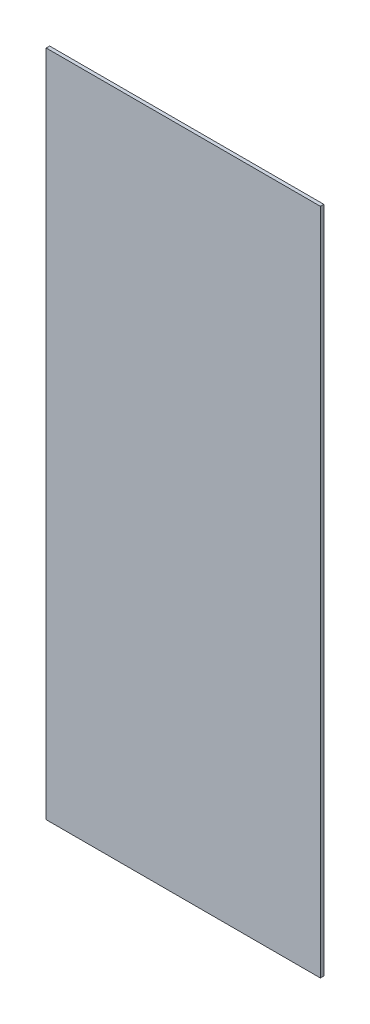
ISO-10303-21;
HEADER;
FILE_DESCRIPTION(('STEP AP214'),'2;1');
FILE_NAME('part.step','',(''),(''),'','','');
FILE_SCHEMA(('AUTOMOTIVE_DESIGN { 1 0 10303 214 1 1 1 1 }'));
ENDSEC;
DATA;
#1=APPLICATION_CONTEXT('core data for automotive mechanical design processes');
#2=APPLICATION_PROTOCOL_DEFINITION('international standard','automotive_design',2000,#1);
#3=PRODUCT_CONTEXT('',#1,'mechanical');
#4=PRODUCT('Part','Part','',(#3));
#5=PRODUCT_RELATED_PRODUCT_CATEGORY('part','',(#4));
#6=PRODUCT_DEFINITION_FORMATION('','',#4);
#7=PRODUCT_DEFINITION_CONTEXT('part definition',#1,'design');
#8=PRODUCT_DEFINITION('design','',#6,#7);
#9=PRODUCT_DEFINITION_SHAPE('','',#8);
#10=(LENGTH_UNIT() NAMED_UNIT(*) SI_UNIT(.MILLI.,.METRE.));
#11=(NAMED_UNIT(*) PLANE_ANGLE_UNIT() SI_UNIT($,.RADIAN.));
#12=(NAMED_UNIT(*) SI_UNIT($,.STERADIAN.) SOLID_ANGLE_UNIT());
#13=UNCERTAINTY_MEASURE_WITH_UNIT(LENGTH_MEASURE(1.E-05),#10,'distance_accuracy_value','');
#14=(GEOMETRIC_REPRESENTATION_CONTEXT(3) GLOBAL_UNCERTAINTY_ASSIGNED_CONTEXT((#13)) GLOBAL_UNIT_ASSIGNED_CONTEXT((#10,
#11,#12)) REPRESENTATION_CONTEXT('',''));
#15=CARTESIAN_POINT('',(0.,0.,0.));
#16=DIRECTION('',(0.,0.,1.));
#17=DIRECTION('',(1.,0.,0.));
#18=AXIS2_PLACEMENT_3D('',#15,#16,#17);
#19=CARTESIAN_POINT('',(305.665681156461,-132.372707695851,1.));
#20=DIRECTION('',(1.,0.,0.));
#21=DIRECTION('',(0.,0.,-1.));
#22=AXIS2_PLACEMENT_3D('',#19,#20,#21);
#23=PLANE('',#22);
#24=DIRECTION('',(0.,-1.,0.));
#25=VECTOR('',#24,1.);
#26=CARTESIAN_POINT('',(305.665681156461,-132.372707695851,0.));
#27=LINE('',#26,#25);
#28=CARTESIAN_POINT('',(305.665681156461,61.627292304149,0.));
#29=VERTEX_POINT('',#28);
#30=CARTESIAN_POINT('',(305.665681156461,-132.372707695851,0.));
#31=VERTEX_POINT('',#30);
#32=EDGE_CURVE('E96',#29,#31,#27,.T.);
#33=ORIENTED_EDGE('',*,*,#32,.T.);
#34=DIRECTION('',(0.,0.,-1.));
#35=VECTOR('',#34,1.);
#36=CARTESIAN_POINT('',(305.665681156461,-132.372707695851,1.));
#37=LINE('',#36,#35);
#38=CARTESIAN_POINT('',(305.665681156461,-132.372707695851,1.));
#39=VERTEX_POINT('',#38);
#40=EDGE_CURVE('E11',#39,#31,#37,.T.);
#41=ORIENTED_EDGE('',*,*,#40,.F.);
#42=DIRECTION('',(0.,-1.,0.));
#43=VECTOR('',#42,1.);
#44=CARTESIAN_POINT('',(305.665681156461,-132.372707695851,1.));
#45=LINE('',#44,#43);
#46=CARTESIAN_POINT('',(305.665681156461,61.627292304149,1.));
#47=VERTEX_POINT('',#46);
#48=EDGE_CURVE('E84',#47,#39,#45,.T.);
#49=ORIENTED_EDGE('',*,*,#48,.F.);
#50=DIRECTION('',(0.,0.,-1.));
#51=VECTOR('',#50,1.);
#52=CARTESIAN_POINT('',(305.665681156461,61.627292304149,1.));
#53=LINE('',#52,#51);
#54=EDGE_CURVE('E92',#47,#29,#53,.T.);
#55=ORIENTED_EDGE('',*,*,#54,.T.);
#56=EDGE_LOOP('',(#33,#41,#49,#55));
#57=FACE_BOUND('',#56,.T.);
#58=ADVANCED_FACE('F33',(#57),#23,.F.);
#59=CARTESIAN_POINT('',(305.665681156461,-132.372707695851,1.));
#60=DIRECTION('',(0.,1.,0.));
#61=DIRECTION('',(0.,0.,1.));
#62=AXIS2_PLACEMENT_3D('',#59,#60,#61);
#63=PLANE('',#62);
#64=DIRECTION('',(1.,0.,0.));
#65=VECTOR('',#64,1.);
#66=CARTESIAN_POINT('',(305.665681156461,-132.372707695851,0.));
#67=LINE('',#66,#65);
#68=CARTESIAN_POINT('',(385.251635434011,-132.372707695851,0.));
#69=VERTEX_POINT('',#68);
#70=EDGE_CURVE('E88',#31,#69,#67,.T.);
#71=ORIENTED_EDGE('',*,*,#70,.T.);
#72=DIRECTION('',(0.,0.,-1.));
#73=VECTOR('',#72,1.);
#74=CARTESIAN_POINT('',(385.251635434011,-132.372707695851,1.));
#75=LINE('',#74,#73);
#76=CARTESIAN_POINT('',(385.251635434011,-132.372707695851,1.));
#77=VERTEX_POINT('',#76);
#78=EDGE_CURVE('E41',#77,#69,#75,.T.);
#79=ORIENTED_EDGE('',*,*,#78,.F.);
#80=DIRECTION('',(1.,0.,0.));
#81=VECTOR('',#80,1.);
#82=CARTESIAN_POINT('',(305.665681156461,-132.372707695851,1.));
#83=LINE('',#82,#81);
#84=EDGE_CURVE('E79',#39,#77,#83,.T.);
#85=ORIENTED_EDGE('',*,*,#84,.F.);
#86=ORIENTED_EDGE('',*,*,#40,.T.);
#87=EDGE_LOOP('',(#71,#79,#85,#86));
#88=FACE_BOUND('',#87,.T.);
#89=ADVANCED_FACE('F87',(#88),#63,.F.);
#90=CARTESIAN_POINT('',(385.251635434011,-132.372707695851,1.));
#91=DIRECTION('',(-1.,0.,0.));
#92=DIRECTION('',(0.,0.,1.));
#93=AXIS2_PLACEMENT_3D('',#90,#91,#92);
#94=PLANE('',#93);
#95=DIRECTION('',(0.,1.,0.));
#96=VECTOR('',#95,1.);
#97=CARTESIAN_POINT('',(385.251635434011,-132.372707695851,0.));
#98=LINE('',#97,#96);
#99=CARTESIAN_POINT('',(385.251635434011,61.627292304149,0.));
#100=VERTEX_POINT('',#99);
#101=EDGE_CURVE('E66',#69,#100,#98,.T.);
#102=ORIENTED_EDGE('',*,*,#101,.T.);
#103=DIRECTION('',(0.,0.,-1.));
#104=VECTOR('',#103,1.);
#105=CARTESIAN_POINT('',(385.251635434011,61.627292304149,1.));
#106=LINE('',#105,#104);
#107=CARTESIAN_POINT('',(385.251635434011,61.627292304149,1.));
#108=VERTEX_POINT('',#107);
#109=EDGE_CURVE('E89',#108,#100,#106,.T.);
#110=ORIENTED_EDGE('',*,*,#109,.F.);
#111=DIRECTION('',(0.,1.,0.));
#112=VECTOR('',#111,1.);
#113=CARTESIAN_POINT('',(385.251635434011,-132.372707695851,1.));
#114=LINE('',#113,#112);
#115=EDGE_CURVE('E82',#77,#108,#114,.T.);
#116=ORIENTED_EDGE('',*,*,#115,.F.);
#117=ORIENTED_EDGE('',*,*,#78,.T.);
#118=EDGE_LOOP('',(#102,#110,#116,#117));
#119=FACE_BOUND('',#118,.T.);
#120=ADVANCED_FACE('F90',(#119),#94,.F.);
#121=CARTESIAN_POINT('',(305.665681156461,61.627292304149,1.));
#122=DIRECTION('',(0.,-1.,0.));
#123=DIRECTION('',(0.,0.,-1.));
#124=AXIS2_PLACEMENT_3D('',#121,#122,#123);
#125=PLANE('',#124);
#126=DIRECTION('',(-1.,0.,0.));
#127=VECTOR('',#126,1.);
#128=CARTESIAN_POINT('',(305.665681156461,61.627292304149,0.));
#129=LINE('',#128,#127);
#130=EDGE_CURVE('E72',#100,#29,#129,.T.);
#131=ORIENTED_EDGE('',*,*,#130,.T.);
#132=ORIENTED_EDGE('',*,*,#54,.F.);
#133=DIRECTION('',(-1.,0.,0.));
#134=VECTOR('',#133,1.);
#135=CARTESIAN_POINT('',(305.665681156461,61.627292304149,1.));
#136=LINE('',#135,#134);
#137=EDGE_CURVE('E49',#108,#47,#136,.T.);
#138=ORIENTED_EDGE('',*,*,#137,.F.);
#139=ORIENTED_EDGE('',*,*,#109,.T.);
#140=EDGE_LOOP('',(#131,#132,#138,#139));
#141=FACE_BOUND('',#140,.T.);
#142=ADVANCED_FACE('F103',(#141),#125,.F.);
#143=CARTESIAN_POINT('',(0.,0.,1.));
#144=DIRECTION('',(0.,0.,-1.));
#145=DIRECTION('',(-1.,0.,0.));
#146=AXIS2_PLACEMENT_3D('',#143,#144,#145);
#147=PLANE('',#146);
#148=ORIENTED_EDGE('',*,*,#48,.T.);
#149=ORIENTED_EDGE('',*,*,#84,.T.);
#150=ORIENTED_EDGE('',*,*,#115,.T.);
#151=ORIENTED_EDGE('',*,*,#137,.T.);
#152=EDGE_LOOP('',(#148,#149,#150,#151));
#153=FACE_BOUND('',#152,.T.);
#154=ADVANCED_FACE('F80',(#153),#147,.F.);
#155=CARTESIAN_POINT('',(0.,0.,0.));
#156=DIRECTION('',(0.,0.,-1.));
#157=DIRECTION('',(-1.,0.,0.));
#158=AXIS2_PLACEMENT_3D('',#155,#156,#157);
#159=PLANE('',#158);
#160=ORIENTED_EDGE('',*,*,#32,.F.);
#161=ORIENTED_EDGE('',*,*,#130,.F.);
#162=ORIENTED_EDGE('',*,*,#101,.F.);
#163=ORIENTED_EDGE('',*,*,#70,.F.);
#164=EDGE_LOOP('',(#160,#161,#162,#163));
#165=FACE_BOUND('',#164,.T.);
#166=ADVANCED_FACE('F106',(#165),#159,.T.);
#167=CLOSED_SHELL('',(#58,#89,#120,#142,#154,#166));
#168=MANIFOLD_SOLID_BREP('B2',#167);
#169=ADVANCED_BREP_SHAPE_REPRESENTATION('',(#18,#168),#14);
#170=SHAPE_DEFINITION_REPRESENTATION(#9,#169);
ENDSEC;
END-ISO-10303-21;
